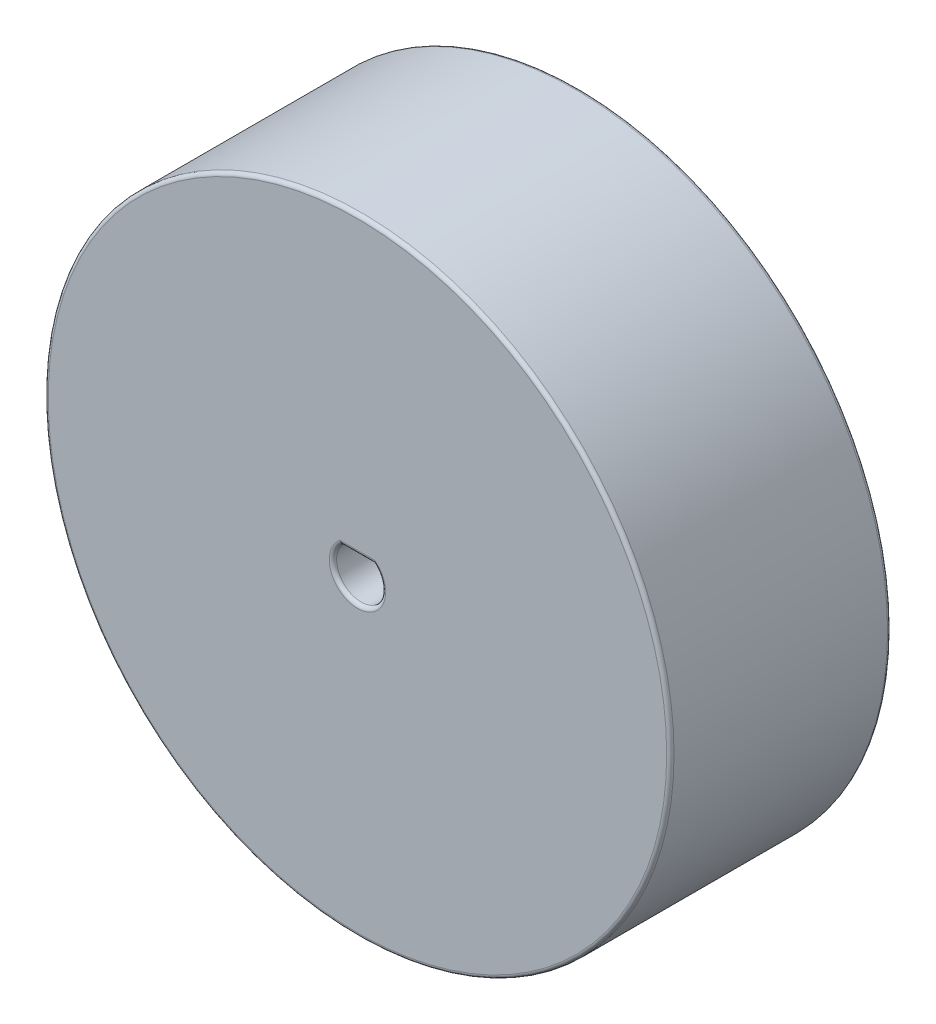
ISO-10303-21;
HEADER;
FILE_DESCRIPTION(('STEP AP214'),'2;1');
FILE_NAME('part.step','',(''),(''),'','','');
FILE_SCHEMA(('AUTOMOTIVE_DESIGN { 1 0 10303 214 1 1 1 1 }'));
ENDSEC;
DATA;
#1=APPLICATION_CONTEXT('core data for automotive mechanical design processes');
#2=APPLICATION_PROTOCOL_DEFINITION('international standard','automotive_design',2000,#1);
#3=PRODUCT_CONTEXT('',#1,'mechanical');
#4=PRODUCT('Part','Part','',(#3));
#5=PRODUCT_RELATED_PRODUCT_CATEGORY('part','',(#4));
#6=PRODUCT_DEFINITION_FORMATION('','',#4);
#7=PRODUCT_DEFINITION_CONTEXT('part definition',#1,'design');
#8=PRODUCT_DEFINITION('design','',#6,#7);
#9=PRODUCT_DEFINITION_SHAPE('','',#8);
#10=(LENGTH_UNIT() NAMED_UNIT(*) SI_UNIT(.MILLI.,.METRE.));
#11=(NAMED_UNIT(*) PLANE_ANGLE_UNIT() SI_UNIT($,.RADIAN.));
#12=(NAMED_UNIT(*) SI_UNIT($,.STERADIAN.) SOLID_ANGLE_UNIT());
#13=UNCERTAINTY_MEASURE_WITH_UNIT(LENGTH_MEASURE(1.E-05),#10,'distance_accuracy_value','');
#14=(GEOMETRIC_REPRESENTATION_CONTEXT(3) GLOBAL_UNCERTAINTY_ASSIGNED_CONTEXT((#13)) GLOBAL_UNIT_ASSIGNED_CONTEXT((#10,
#11,#12)) REPRESENTATION_CONTEXT('',''));
#15=CARTESIAN_POINT('',(0.,0.,0.));
#16=DIRECTION('',(0.,0.,1.));
#17=DIRECTION('',(1.,0.,0.));
#18=AXIS2_PLACEMENT_3D('',#15,#16,#17);
#19=CARTESIAN_POINT('',(0.,0.,0.));
#20=DIRECTION('',(0.,0.,1.));
#21=DIRECTION('',(1.,0.,0.));
#22=AXIS2_PLACEMENT_3D('',#19,#20,#21);
#23=PLANE('',#22);
#24=CARTESIAN_POINT('',(0.,0.,0.));
#25=DIRECTION('',(0.,0.,1.));
#26=DIRECTION('',(1.,0.,0.));
#27=AXIS2_PLACEMENT_3D('',#24,#25,#26);
#28=CIRCLE('',#27,25.2);
#29=CARTESIAN_POINT('',(25.2,0.,0.));
#30=VERTEX_POINT('',#29);
#31=EDGE_CURVE('E11',#30,#30,#28,.F.);
#32=ORIENTED_EDGE('',*,*,#31,.T.);
#33=EDGE_LOOP('',(#32));
#34=FACE_BOUND('',#33,.T.);
#35=CARTESIAN_POINT('',(0.,0.,0.));
#36=DIRECTION('',(0.,0.,-1.));
#37=DIRECTION('',(-1.,0.,0.));
#38=AXIS2_PLACEMENT_3D('',#35,#36,#37);
#39=CIRCLE('',#38,4.00020877501328);
#40=CARTESIAN_POINT('',(3.70832445232254,-1.5,0.));
#41=VERTEX_POINT('',#40);
#42=CARTESIAN_POINT('',(1.5,-3.70832445232254,0.));
#43=VERTEX_POINT('',#42);
#44=EDGE_CURVE('E230',#41,#43,#39,.T.);
#45=ORIENTED_EDGE('',*,*,#44,.T.);
#46=DIRECTION('',(0.,-1.,0.));
#47=VECTOR('',#46,1.);
#48=CARTESIAN_POINT('',(1.5,0.,0.));
#49=LINE('',#48,#47);
#50=CARTESIAN_POINT('',(1.5,-23.953079134007,0.));
#51=VERTEX_POINT('',#50);
#52=EDGE_CURVE('E221',#43,#51,#49,.T.);
#53=ORIENTED_EDGE('',*,*,#52,.T.);
#54=CARTESIAN_POINT('',(0.,0.,0.));
#55=DIRECTION('',(0.,0.,-1.));
#56=DIRECTION('',(-1.,0.,0.));
#57=AXIS2_PLACEMENT_3D('',#54,#55,#56);
#58=CIRCLE('',#57,24.);
#59=CARTESIAN_POINT('',(23.953079134007,-1.5,0.));
#60=VERTEX_POINT('',#59);
#61=EDGE_CURVE('E237',#60,#51,#58,.T.);
#62=ORIENTED_EDGE('',*,*,#61,.F.);
#63=DIRECTION('',(1.,0.,0.));
#64=VECTOR('',#63,1.);
#65=CARTESIAN_POINT('',(0.,-1.5,0.));
#66=LINE('',#65,#64);
#67=EDGE_CURVE('E233',#41,#60,#66,.T.);
#68=ORIENTED_EDGE('',*,*,#67,.F.);
#69=EDGE_LOOP('',(#45,#53,#62,#68));
#70=FACE_BOUND('',#69,.T.);
#71=CARTESIAN_POINT('',(0.,0.,0.));
#72=DIRECTION('',(0.,0.,-1.));
#73=DIRECTION('',(-1.,0.,0.));
#74=AXIS2_PLACEMENT_3D('',#71,#72,#73);
#75=CIRCLE('',#74,4.00020877501328);
#76=CARTESIAN_POINT('',(-3.70832445232254,1.5,0.));
#77=VERTEX_POINT('',#76);
#78=CARTESIAN_POINT('',(-1.5,3.70832445232254,0.));
#79=VERTEX_POINT('',#78);
#80=EDGE_CURVE('E213',#77,#79,#75,.T.);
#81=ORIENTED_EDGE('',*,*,#80,.T.);
#82=DIRECTION('',(0.,1.,0.));
#83=VECTOR('',#82,1.);
#84=CARTESIAN_POINT('',(-1.5,0.,0.));
#85=LINE('',#84,#83);
#86=CARTESIAN_POINT('',(-1.5,23.953079134007,0.));
#87=VERTEX_POINT('',#86);
#88=EDGE_CURVE('E286',#79,#87,#85,.T.);
#89=ORIENTED_EDGE('',*,*,#88,.T.);
#90=CARTESIAN_POINT('',(0.,0.,0.));
#91=DIRECTION('',(0.,0.,-1.));
#92=DIRECTION('',(-1.,0.,0.));
#93=AXIS2_PLACEMENT_3D('',#90,#91,#92);
#94=CIRCLE('',#93,24.);
#95=CARTESIAN_POINT('',(-23.953079134007,1.5,0.));
#96=VERTEX_POINT('',#95);
#97=EDGE_CURVE('E300',#96,#87,#94,.T.);
#98=ORIENTED_EDGE('',*,*,#97,.F.);
#99=DIRECTION('',(-1.,0.,0.));
#100=VECTOR('',#99,1.);
#101=CARTESIAN_POINT('',(0.,1.5,0.));
#102=LINE('',#101,#100);
#103=EDGE_CURVE('E297',#77,#96,#102,.T.);
#104=ORIENTED_EDGE('',*,*,#103,.F.);
#105=EDGE_LOOP('',(#81,#89,#98,#104));
#106=FACE_BOUND('',#105,.T.);
#107=CARTESIAN_POINT('',(0.,0.,0.));
#108=DIRECTION('',(0.,0.,-1.));
#109=DIRECTION('',(-1.,0.,0.));
#110=AXIS2_PLACEMENT_3D('',#107,#108,#109);
#111=CIRCLE('',#110,4.00020877501328);
#112=CARTESIAN_POINT('',(-1.5,-3.70832445232254,0.));
#113=VERTEX_POINT('',#112);
#114=CARTESIAN_POINT('',(-3.70832445232254,-1.5,0.));
#115=VERTEX_POINT('',#114);
#116=EDGE_CURVE('E263',#113,#115,#111,.T.);
#117=ORIENTED_EDGE('',*,*,#116,.T.);
#118=DIRECTION('',(-1.,0.,0.));
#119=VECTOR('',#118,1.);
#120=CARTESIAN_POINT('',(0.,-1.5,0.));
#121=LINE('',#120,#119);
#122=CARTESIAN_POINT('',(-23.953079134007,-1.5,0.));
#123=VERTEX_POINT('',#122);
#124=EDGE_CURVE('E254',#115,#123,#121,.T.);
#125=ORIENTED_EDGE('',*,*,#124,.T.);
#126=CARTESIAN_POINT('',(0.,0.,0.));
#127=DIRECTION('',(0.,0.,-1.));
#128=DIRECTION('',(-1.,0.,0.));
#129=AXIS2_PLACEMENT_3D('',#126,#127,#128);
#130=CIRCLE('',#129,24.);
#131=CARTESIAN_POINT('',(-1.5,-23.953079134007,0.));
#132=VERTEX_POINT('',#131);
#133=EDGE_CURVE('E269',#132,#123,#130,.T.);
#134=ORIENTED_EDGE('',*,*,#133,.F.);
#135=DIRECTION('',(0.,-1.,0.));
#136=VECTOR('',#135,1.);
#137=CARTESIAN_POINT('',(-1.5,0.,0.));
#138=LINE('',#137,#136);
#139=EDGE_CURVE('E266',#113,#132,#138,.T.);
#140=ORIENTED_EDGE('',*,*,#139,.F.);
#141=EDGE_LOOP('',(#117,#125,#134,#140));
#142=FACE_BOUND('',#141,.T.);
#143=CARTESIAN_POINT('',(0.,0.,0.));
#144=DIRECTION('',(0.,0.,-1.));
#145=DIRECTION('',(-1.,0.,0.));
#146=AXIS2_PLACEMENT_3D('',#143,#144,#145);
#147=CIRCLE('',#146,4.00020877501328);
#148=CARTESIAN_POINT('',(1.5,3.70832445232254,0.));
#149=VERTEX_POINT('',#148);
#150=CARTESIAN_POINT('',(3.70832445232254,1.5,0.));
#151=VERTEX_POINT('',#150);
#152=EDGE_CURVE('E180',#149,#151,#147,.T.);
#153=ORIENTED_EDGE('',*,*,#152,.T.);
#154=DIRECTION('',(1.,0.,0.));
#155=VECTOR('',#154,1.);
#156=CARTESIAN_POINT('',(0.,1.5,0.));
#157=LINE('',#156,#155);
#158=CARTESIAN_POINT('',(23.953079134007,1.5,0.));
#159=VERTEX_POINT('',#158);
#160=EDGE_CURVE('E193',#151,#159,#157,.T.);
#161=ORIENTED_EDGE('',*,*,#160,.T.);
#162=CARTESIAN_POINT('',(0.,0.,0.));
#163=DIRECTION('',(0.,0.,-1.));
#164=DIRECTION('',(-1.,0.,0.));
#165=AXIS2_PLACEMENT_3D('',#162,#163,#164);
#166=CIRCLE('',#165,24.);
#167=CARTESIAN_POINT('',(1.5,23.953079134007,0.));
#168=VERTEX_POINT('',#167);
#169=EDGE_CURVE('E206',#168,#159,#166,.T.);
#170=ORIENTED_EDGE('',*,*,#169,.F.);
#171=DIRECTION('',(0.,1.,0.));
#172=VECTOR('',#171,1.);
#173=CARTESIAN_POINT('',(1.5,0.,0.));
#174=LINE('',#173,#172);
#175=EDGE_CURVE('E203',#149,#168,#174,.T.);
#176=ORIENTED_EDGE('',*,*,#175,.F.);
#177=EDGE_LOOP('',(#153,#161,#170,#176));
#178=FACE_BOUND('',#177,.T.);
#179=ADVANCED_FACE('F34',(#34,#70,#106,#142,#178),#23,.F.);
#180=CARTESIAN_POINT('',(0.,0.,18.));
#181=DIRECTION('',(0.,0.,-1.));
#182=DIRECTION('',(-1.,0.,0.));
#183=AXIS2_PLACEMENT_3D('',#180,#181,#182);
#184=CYLINDRICAL_SURFACE('',#183,25.5);
#185=CARTESIAN_POINT('',(0.,0.,17.7));
#186=DIRECTION('',(0.,0.,1.));
#187=DIRECTION('',(1.,0.,0.));
#188=AXIS2_PLACEMENT_3D('',#185,#186,#187);
#189=CIRCLE('',#188,25.5);
#190=CARTESIAN_POINT('',(25.5,0.,17.7));
#191=VERTEX_POINT('',#190);
#192=EDGE_CURVE('E49',#191,#191,#189,.F.);
#193=ORIENTED_EDGE('',*,*,#192,.T.);
#194=EDGE_LOOP('',(#193));
#195=FACE_BOUND('',#194,.T.);
#196=CARTESIAN_POINT('',(0.,0.,0.300000000000002));
#197=DIRECTION('',(0.,0.,1.));
#198=DIRECTION('',(1.,0.,0.));
#199=AXIS2_PLACEMENT_3D('',#196,#197,#198);
#200=CIRCLE('',#199,25.5);
#201=CARTESIAN_POINT('',(25.5,0.,0.300000000000002));
#202=VERTEX_POINT('',#201);
#203=EDGE_CURVE('E337',#202,#202,#200,.T.);
#204=ORIENTED_EDGE('',*,*,#203,.T.);
#205=EDGE_LOOP('',(#204));
#206=FACE_BOUND('',#205,.T.);
#207=ADVANCED_FACE('F365',(#195,#206),#184,.T.);
#208=CARTESIAN_POINT('',(0.,0.,18.));
#209=DIRECTION('',(0.,0.,1.));
#210=DIRECTION('',(1.,0.,0.));
#211=AXIS2_PLACEMENT_3D('',#208,#209,#210);
#212=PLANE('',#211);
#213=CARTESIAN_POINT('',(0.,0.,18.));
#214=DIRECTION('',(0.,0.,1.));
#215=DIRECTION('',(1.,0.,0.));
#216=AXIS2_PLACEMENT_3D('',#213,#214,#215);
#217=CIRCLE('',#216,2.3);
#218=CARTESIAN_POINT('',(1.43178210633003,1.79999999999809,18.));
#219=VERTEX_POINT('',#218);
#220=CARTESIAN_POINT('',(-1.43178210633003,1.79999999999809,18.));
#221=VERTEX_POINT('',#220);
#222=EDGE_CURVE('E56',#219,#221,#217,.F.);
#223=ORIENTED_EDGE('',*,*,#222,.T.);
#224=DIRECTION('',(-1.,0.,0.));
#225=VECTOR('',#224,1.);
#226=CARTESIAN_POINT('',(1.3228756555323,1.8,18.));
#227=LINE('',#226,#225);
#228=EDGE_CURVE('E333',#221,#219,#227,.F.);
#229=ORIENTED_EDGE('',*,*,#228,.T.);
#230=EDGE_LOOP('',(#223,#229));
#231=FACE_BOUND('',#230,.T.);
#232=CARTESIAN_POINT('',(0.,0.,18.));
#233=DIRECTION('',(0.,0.,1.));
#234=DIRECTION('',(1.,0.,0.));
#235=AXIS2_PLACEMENT_3D('',#232,#233,#234);
#236=CIRCLE('',#235,25.2);
#237=CARTESIAN_POINT('',(25.2,0.,18.));
#238=VERTEX_POINT('',#237);
#239=EDGE_CURVE('E329',#238,#238,#236,.T.);
#240=ORIENTED_EDGE('',*,*,#239,.T.);
#241=EDGE_LOOP('',(#240));
#242=FACE_BOUND('',#241,.T.);
#243=ADVANCED_FACE('F371',(#231,#242),#212,.T.);
#244=CARTESIAN_POINT('',(0.,0.,8.));
#245=DIRECTION('',(0.,0.,1.));
#246=DIRECTION('',(1.,0.,0.));
#247=AXIS2_PLACEMENT_3D('',#244,#245,#246);
#248=CYLINDRICAL_SURFACE('',#247,2.);
#249=DIRECTION('',(0.,0.,1.));
#250=VECTOR('',#249,1.);
#251=CARTESIAN_POINT('',(-1.3228756555323,1.5,8.));
#252=LINE('',#251,#250);
#253=CARTESIAN_POINT('',(-1.3228756555323,1.5,8.));
#254=VERTEX_POINT('',#253);
#255=CARTESIAN_POINT('',(-1.3228756555323,1.5,17.7));
#256=VERTEX_POINT('',#255);
#257=EDGE_CURVE('E321',#254,#256,#252,.T.);
#258=ORIENTED_EDGE('',*,*,#257,.T.);
#259=CARTESIAN_POINT('',(0.,0.,17.7));
#260=DIRECTION('',(0.,0.,1.));
#261=DIRECTION('',(1.,0.,0.));
#262=AXIS2_PLACEMENT_3D('',#259,#260,#261);
#263=CIRCLE('',#262,2.);
#264=CARTESIAN_POINT('',(1.3228756555323,1.5,17.7));
#265=VERTEX_POINT('',#264);
#266=EDGE_CURVE('E335',#256,#265,#263,.T.);
#267=ORIENTED_EDGE('',*,*,#266,.T.);
#268=DIRECTION('',(0.,0.,1.));
#269=VECTOR('',#268,1.);
#270=CARTESIAN_POINT('',(1.3228756555323,1.5,8.));
#271=LINE('',#270,#269);
#272=CARTESIAN_POINT('',(1.3228756555323,1.5,8.));
#273=VERTEX_POINT('',#272);
#274=EDGE_CURVE('E320',#273,#265,#271,.T.);
#275=ORIENTED_EDGE('',*,*,#274,.F.);
#276=CARTESIAN_POINT('',(0.,0.,8.));
#277=DIRECTION('',(0.,0.,1.));
#278=DIRECTION('',(-1.,0.,0.));
#279=AXIS2_PLACEMENT_3D('',#276,#277,#278);
#280=CIRCLE('',#279,2.);
#281=EDGE_CURVE('E308',#254,#273,#280,.T.);
#282=ORIENTED_EDGE('',*,*,#281,.F.);
#283=EDGE_LOOP('',(#258,#267,#275,#282));
#284=FACE_BOUND('',#283,.T.);
#285=ADVANCED_FACE('F377',(#284),#248,.F.);
#286=CARTESIAN_POINT('',(1.3228756555323,1.5,8.));
#287=DIRECTION('',(0.,1.,0.));
#288=DIRECTION('',(0.,0.,1.));
#289=AXIS2_PLACEMENT_3D('',#286,#287,#288);
#290=PLANE('',#289);
#291=ORIENTED_EDGE('',*,*,#274,.T.);
#292=DIRECTION('',(-1.,0.,0.));
#293=VECTOR('',#292,1.);
#294=CARTESIAN_POINT('',(-1.3228756555323,1.5,17.7));
#295=LINE('',#294,#293);
#296=EDGE_CURVE('E324',#265,#256,#295,.T.);
#297=ORIENTED_EDGE('',*,*,#296,.T.);
#298=ORIENTED_EDGE('',*,*,#257,.F.);
#299=DIRECTION('',(-1.,0.,0.));
#300=VECTOR('',#299,1.);
#301=CARTESIAN_POINT('',(1.3228756555323,1.5,8.));
#302=LINE('',#301,#300);
#303=EDGE_CURVE('E317',#273,#254,#302,.T.);
#304=ORIENTED_EDGE('',*,*,#303,.F.);
#305=EDGE_LOOP('',(#291,#297,#298,#304));
#306=FACE_BOUND('',#305,.T.);
#307=ADVANCED_FACE('F380',(#306),#290,.F.);
#308=CARTESIAN_POINT('',(0.,0.,8.));
#309=DIRECTION('',(0.,0.,-1.));
#310=DIRECTION('',(-1.,0.,0.));
#311=AXIS2_PLACEMENT_3D('',#308,#309,#310);
#312=PLANE('',#311);
#313=ORIENTED_EDGE('',*,*,#281,.T.);
#314=ORIENTED_EDGE('',*,*,#303,.T.);
#315=EDGE_LOOP('',(#313,#314));
#316=FACE_BOUND('',#315,.T.);
#317=ADVANCED_FACE('F384',(#316),#312,.F.);
#318=CARTESIAN_POINT('',(0.,0.,5.));
#319=DIRECTION('',(0.,0.,-1.));
#320=DIRECTION('',(-1.,0.,0.));
#321=AXIS2_PLACEMENT_3D('',#318,#319,#320);
#322=CYLINDRICAL_SURFACE('',#321,4.00020877501328);
#323=ORIENTED_EDGE('',*,*,#80,.F.);
#324=DIRECTION('',(0.,0.,-1.));
#325=VECTOR('',#324,1.);
#326=CARTESIAN_POINT('',(-3.70832445232254,1.5,5.));
#327=LINE('',#326,#325);
#328=CARTESIAN_POINT('',(-3.70832445232254,1.5,5.));
#329=VERTEX_POINT('',#328);
#330=EDGE_CURVE('E294',#329,#77,#327,.T.);
#331=ORIENTED_EDGE('',*,*,#330,.F.);
#332=CARTESIAN_POINT('',(0.,0.,5.));
#333=DIRECTION('',(0.,0.,-1.));
#334=DIRECTION('',(-1.,0.,0.));
#335=AXIS2_PLACEMENT_3D('',#332,#333,#334);
#336=CIRCLE('',#335,4.00020877501328);
#337=CARTESIAN_POINT('',(-1.5,3.70832445232254,5.));
#338=VERTEX_POINT('',#337);
#339=EDGE_CURVE('E282',#329,#338,#336,.T.);
#340=ORIENTED_EDGE('',*,*,#339,.T.);
#341=DIRECTION('',(0.,0.,-1.));
#342=VECTOR('',#341,1.);
#343=CARTESIAN_POINT('',(-1.5,3.70832445232254,5.));
#344=LINE('',#343,#342);
#345=EDGE_CURVE('E305',#338,#79,#344,.T.);
#346=ORIENTED_EDGE('',*,*,#345,.T.);
#347=EDGE_LOOP('',(#323,#331,#340,#346));
#348=FACE_BOUND('',#347,.T.);
#349=ADVANCED_FACE('F388',(#348),#322,.T.);
#350=CARTESIAN_POINT('',(-1.5,0.,5.));
#351=DIRECTION('',(-1.,0.,0.));
#352=DIRECTION('',(0.,0.,1.));
#353=AXIS2_PLACEMENT_3D('',#350,#351,#352);
#354=PLANE('',#353);
#355=ORIENTED_EDGE('',*,*,#88,.F.);
#356=ORIENTED_EDGE('',*,*,#345,.F.);
#357=DIRECTION('',(0.,1.,0.));
#358=VECTOR('',#357,1.);
#359=CARTESIAN_POINT('',(-1.5,0.,5.));
#360=LINE('',#359,#358);
#361=CARTESIAN_POINT('',(-1.5,23.953079134007,5.));
#362=VERTEX_POINT('',#361);
#363=EDGE_CURVE('E292',#338,#362,#360,.T.);
#364=ORIENTED_EDGE('',*,*,#363,.T.);
#365=DIRECTION('',(0.,0.,-1.));
#366=VECTOR('',#365,1.);
#367=CARTESIAN_POINT('',(-1.5,23.953079134007,5.));
#368=LINE('',#367,#366);
#369=EDGE_CURVE('E309',#362,#87,#368,.T.);
#370=ORIENTED_EDGE('',*,*,#369,.T.);
#371=EDGE_LOOP('',(#355,#356,#364,#370));
#372=FACE_BOUND('',#371,.T.);
#373=ADVANCED_FACE('F392',(#372),#354,.T.);
#374=CARTESIAN_POINT('',(0.,0.,5.));
#375=DIRECTION('',(0.,0.,-1.));
#376=DIRECTION('',(-1.,0.,0.));
#377=AXIS2_PLACEMENT_3D('',#374,#375,#376);
#378=CYLINDRICAL_SURFACE('',#377,24.);
#379=ORIENTED_EDGE('',*,*,#97,.T.);
#380=ORIENTED_EDGE('',*,*,#369,.F.);
#381=CARTESIAN_POINT('',(0.,0.,5.));
#382=DIRECTION('',(0.,0.,-1.));
#383=DIRECTION('',(-1.,0.,0.));
#384=AXIS2_PLACEMENT_3D('',#381,#382,#383);
#385=CIRCLE('',#384,24.);
#386=CARTESIAN_POINT('',(-23.953079134007,1.5,5.));
#387=VERTEX_POINT('',#386);
#388=EDGE_CURVE('E289',#387,#362,#385,.T.);
#389=ORIENTED_EDGE('',*,*,#388,.F.);
#390=DIRECTION('',(0.,0.,-1.));
#391=VECTOR('',#390,1.);
#392=CARTESIAN_POINT('',(-23.953079134007,1.5,5.));
#393=LINE('',#392,#391);
#394=EDGE_CURVE('E311',#387,#96,#393,.T.);
#395=ORIENTED_EDGE('',*,*,#394,.T.);
#396=EDGE_LOOP('',(#379,#380,#389,#395));
#397=FACE_BOUND('',#396,.T.);
#398=ADVANCED_FACE('F398',(#397),#378,.F.);
#399=CARTESIAN_POINT('',(0.,1.5,5.));
#400=DIRECTION('',(0.,-1.,0.));
#401=DIRECTION('',(0.,0.,-1.));
#402=AXIS2_PLACEMENT_3D('',#399,#400,#401);
#403=PLANE('',#402);
#404=ORIENTED_EDGE('',*,*,#103,.T.);
#405=ORIENTED_EDGE('',*,*,#394,.F.);
#406=DIRECTION('',(-1.,0.,0.));
#407=VECTOR('',#406,1.);
#408=CARTESIAN_POINT('',(0.,1.5,5.));
#409=LINE('',#408,#407);
#410=EDGE_CURVE('E285',#329,#387,#409,.T.);
#411=ORIENTED_EDGE('',*,*,#410,.F.);
#412=ORIENTED_EDGE('',*,*,#330,.T.);
#413=EDGE_LOOP('',(#404,#405,#411,#412));
#414=FACE_BOUND('',#413,.T.);
#415=ADVANCED_FACE('F394',(#414),#403,.F.);
#416=CARTESIAN_POINT('',(0.,0.,5.));
#417=DIRECTION('',(0.,0.,-1.));
#418=DIRECTION('',(-1.,0.,0.));
#419=AXIS2_PLACEMENT_3D('',#416,#417,#418);
#420=PLANE('',#419);
#421=ORIENTED_EDGE('',*,*,#339,.F.);
#422=ORIENTED_EDGE('',*,*,#410,.T.);
#423=ORIENTED_EDGE('',*,*,#388,.T.);
#424=ORIENTED_EDGE('',*,*,#363,.F.);
#425=EDGE_LOOP('',(#421,#422,#423,#424));
#426=FACE_BOUND('',#425,.T.);
#427=ADVANCED_FACE('F397',(#426),#420,.T.);
#428=CARTESIAN_POINT('',(0.,0.,5.));
#429=DIRECTION('',(0.,0.,-1.));
#430=DIRECTION('',(-1.,0.,0.));
#431=AXIS2_PLACEMENT_3D('',#428,#429,#430);
#432=CYLINDRICAL_SURFACE('',#431,4.00020877501328);
#433=ORIENTED_EDGE('',*,*,#116,.F.);
#434=DIRECTION('',(0.,0.,-1.));
#435=VECTOR('',#434,1.);
#436=CARTESIAN_POINT('',(-1.5,-3.70832445232254,5.));
#437=LINE('',#436,#435);
#438=CARTESIAN_POINT('',(-1.5,-3.70832445232254,5.));
#439=VERTEX_POINT('',#438);
#440=EDGE_CURVE('E262',#439,#113,#437,.T.);
#441=ORIENTED_EDGE('',*,*,#440,.F.);
#442=CARTESIAN_POINT('',(0.,0.,5.));
#443=DIRECTION('',(0.,0.,-1.));
#444=DIRECTION('',(-1.,0.,0.));
#445=AXIS2_PLACEMENT_3D('',#442,#443,#444);
#446=CIRCLE('',#445,4.00020877501328);
#447=CARTESIAN_POINT('',(-3.70832445232254,-1.5,5.));
#448=VERTEX_POINT('',#447);
#449=EDGE_CURVE('E250',#439,#448,#446,.T.);
#450=ORIENTED_EDGE('',*,*,#449,.T.);
#451=DIRECTION('',(0.,0.,-1.));
#452=VECTOR('',#451,1.);
#453=CARTESIAN_POINT('',(-3.70832445232254,-1.5,5.));
#454=LINE('',#453,#452);
#455=EDGE_CURVE('E234',#448,#115,#454,.T.);
#456=ORIENTED_EDGE('',*,*,#455,.T.);
#457=EDGE_LOOP('',(#433,#441,#450,#456));
#458=FACE_BOUND('',#457,.T.);
#459=ADVANCED_FACE('F408',(#458),#432,.T.);
#460=CARTESIAN_POINT('',(0.,-1.5,5.));
#461=DIRECTION('',(0.,-1.,0.));
#462=DIRECTION('',(0.,0.,-1.));
#463=AXIS2_PLACEMENT_3D('',#460,#461,#462);
#464=PLANE('',#463);
#465=ORIENTED_EDGE('',*,*,#124,.F.);
#466=ORIENTED_EDGE('',*,*,#455,.F.);
#467=DIRECTION('',(-1.,0.,0.));
#468=VECTOR('',#467,1.);
#469=CARTESIAN_POINT('',(0.,-1.5,5.));
#470=LINE('',#469,#468);
#471=CARTESIAN_POINT('',(-23.953079134007,-1.5,5.));
#472=VERTEX_POINT('',#471);
#473=EDGE_CURVE('E260',#448,#472,#470,.T.);
#474=ORIENTED_EDGE('',*,*,#473,.T.);
#475=DIRECTION('',(0.,0.,-1.));
#476=VECTOR('',#475,1.);
#477=CARTESIAN_POINT('',(-23.953079134007,-1.5,5.));
#478=LINE('',#477,#476);
#479=EDGE_CURVE('E276',#472,#123,#478,.T.);
#480=ORIENTED_EDGE('',*,*,#479,.T.);
#481=EDGE_LOOP('',(#465,#466,#474,#480));
#482=FACE_BOUND('',#481,.T.);
#483=ADVANCED_FACE('F412',(#482),#464,.T.);
#484=CARTESIAN_POINT('',(0.,0.,5.));
#485=DIRECTION('',(0.,0.,-1.));
#486=DIRECTION('',(-1.,0.,0.));
#487=AXIS2_PLACEMENT_3D('',#484,#485,#486);
#488=CYLINDRICAL_SURFACE('',#487,24.);
#489=ORIENTED_EDGE('',*,*,#133,.T.);
#490=ORIENTED_EDGE('',*,*,#479,.F.);
#491=CARTESIAN_POINT('',(0.,0.,5.));
#492=DIRECTION('',(0.,0.,-1.));
#493=DIRECTION('',(-1.,0.,0.));
#494=AXIS2_PLACEMENT_3D('',#491,#492,#493);
#495=CIRCLE('',#494,24.);
#496=CARTESIAN_POINT('',(-1.5,-23.953079134007,5.));
#497=VERTEX_POINT('',#496);
#498=EDGE_CURVE('E257',#497,#472,#495,.T.);
#499=ORIENTED_EDGE('',*,*,#498,.F.);
#500=DIRECTION('',(0.,0.,-1.));
#501=VECTOR('',#500,1.);
#502=CARTESIAN_POINT('',(-1.5,-23.953079134007,5.));
#503=LINE('',#502,#501);
#504=EDGE_CURVE('E278',#497,#132,#503,.T.);
#505=ORIENTED_EDGE('',*,*,#504,.T.);
#506=EDGE_LOOP('',(#489,#490,#499,#505));
#507=FACE_BOUND('',#506,.T.);
#508=ADVANCED_FACE('F418',(#507),#488,.F.);
#509=CARTESIAN_POINT('',(-1.5,0.,5.));
#510=DIRECTION('',(1.,0.,0.));
#511=DIRECTION('',(0.,1.,0.));
#512=AXIS2_PLACEMENT_3D('',#509,#510,#511);
#513=PLANE('',#512);
#514=ORIENTED_EDGE('',*,*,#139,.T.);
#515=ORIENTED_EDGE('',*,*,#504,.F.);
#516=DIRECTION('',(0.,-1.,0.));
#517=VECTOR('',#516,1.);
#518=CARTESIAN_POINT('',(-1.5,0.,5.));
#519=LINE('',#518,#517);
#520=EDGE_CURVE('E253',#439,#497,#519,.T.);
#521=ORIENTED_EDGE('',*,*,#520,.F.);
#522=ORIENTED_EDGE('',*,*,#440,.T.);
#523=EDGE_LOOP('',(#514,#515,#521,#522));
#524=FACE_BOUND('',#523,.T.);
#525=ADVANCED_FACE('F414',(#524),#513,.F.);
#526=CARTESIAN_POINT('',(0.,0.,5.));
#527=DIRECTION('',(0.,0.,-1.));
#528=DIRECTION('',(-1.,0.,0.));
#529=AXIS2_PLACEMENT_3D('',#526,#527,#528);
#530=PLANE('',#529);
#531=ORIENTED_EDGE('',*,*,#449,.F.);
#532=ORIENTED_EDGE('',*,*,#520,.T.);
#533=ORIENTED_EDGE('',*,*,#498,.T.);
#534=ORIENTED_EDGE('',*,*,#473,.F.);
#535=EDGE_LOOP('',(#531,#532,#533,#534));
#536=FACE_BOUND('',#535,.T.);
#537=ADVANCED_FACE('F417',(#536),#530,.T.);
#538=CARTESIAN_POINT('',(0.,0.,5.));
#539=DIRECTION('',(0.,0.,-1.));
#540=DIRECTION('',(-1.,0.,0.));
#541=AXIS2_PLACEMENT_3D('',#538,#539,#540);
#542=CYLINDRICAL_SURFACE('',#541,4.00020877501328);
#543=ORIENTED_EDGE('',*,*,#44,.F.);
#544=DIRECTION('',(0.,0.,-1.));
#545=VECTOR('',#544,1.);
#546=CARTESIAN_POINT('',(3.70832445232254,-1.5,5.));
#547=LINE('',#546,#545);
#548=CARTESIAN_POINT('',(3.70832445232254,-1.5,5.));
#549=VERTEX_POINT('',#548);
#550=EDGE_CURVE('E229',#549,#41,#547,.T.);
#551=ORIENTED_EDGE('',*,*,#550,.F.);
#552=CARTESIAN_POINT('',(0.,0.,5.));
#553=DIRECTION('',(0.,0.,-1.));
#554=DIRECTION('',(-1.,0.,0.));
#555=AXIS2_PLACEMENT_3D('',#552,#553,#554);
#556=CIRCLE('',#555,4.00020877501328);
#557=CARTESIAN_POINT('',(1.5,-3.70832445232254,5.));
#558=VERTEX_POINT('',#557);
#559=EDGE_CURVE('E217',#549,#558,#556,.T.);
#560=ORIENTED_EDGE('',*,*,#559,.T.);
#561=DIRECTION('',(0.,0.,-1.));
#562=VECTOR('',#561,1.);
#563=CARTESIAN_POINT('',(1.5,-3.70832445232254,5.));
#564=LINE('',#563,#562);
#565=EDGE_CURVE('E204',#558,#43,#564,.T.);
#566=ORIENTED_EDGE('',*,*,#565,.T.);
#567=EDGE_LOOP('',(#543,#551,#560,#566));
#568=FACE_BOUND('',#567,.T.);
#569=ADVANCED_FACE('F428',(#568),#542,.T.);
#570=CARTESIAN_POINT('',(1.5,0.,5.));
#571=DIRECTION('',(1.,0.,0.));
#572=DIRECTION('',(0.,1.,0.));
#573=AXIS2_PLACEMENT_3D('',#570,#571,#572);
#574=PLANE('',#573);
#575=ORIENTED_EDGE('',*,*,#52,.F.);
#576=ORIENTED_EDGE('',*,*,#565,.F.);
#577=DIRECTION('',(0.,-1.,0.));
#578=VECTOR('',#577,1.);
#579=CARTESIAN_POINT('',(1.5,0.,5.));
#580=LINE('',#579,#578);
#581=CARTESIAN_POINT('',(1.5,-23.953079134007,5.));
#582=VERTEX_POINT('',#581);
#583=EDGE_CURVE('E227',#558,#582,#580,.T.);
#584=ORIENTED_EDGE('',*,*,#583,.T.);
#585=DIRECTION('',(0.,0.,-1.));
#586=VECTOR('',#585,1.);
#587=CARTESIAN_POINT('',(1.5,-23.953079134007,5.));
#588=LINE('',#587,#586);
#589=EDGE_CURVE('E244',#582,#51,#588,.T.);
#590=ORIENTED_EDGE('',*,*,#589,.T.);
#591=EDGE_LOOP('',(#575,#576,#584,#590));
#592=FACE_BOUND('',#591,.T.);
#593=ADVANCED_FACE('F432',(#592),#574,.T.);
#594=CARTESIAN_POINT('',(0.,0.,5.));
#595=DIRECTION('',(0.,0.,-1.));
#596=DIRECTION('',(-1.,0.,0.));
#597=AXIS2_PLACEMENT_3D('',#594,#595,#596);
#598=CYLINDRICAL_SURFACE('',#597,24.);
#599=ORIENTED_EDGE('',*,*,#61,.T.);
#600=ORIENTED_EDGE('',*,*,#589,.F.);
#601=CARTESIAN_POINT('',(0.,0.,5.));
#602=DIRECTION('',(0.,0.,-1.));
#603=DIRECTION('',(-1.,0.,0.));
#604=AXIS2_PLACEMENT_3D('',#601,#602,#603);
#605=CIRCLE('',#604,24.);
#606=CARTESIAN_POINT('',(23.953079134007,-1.5,5.));
#607=VERTEX_POINT('',#606);
#608=EDGE_CURVE('E224',#607,#582,#605,.T.);
#609=ORIENTED_EDGE('',*,*,#608,.F.);
#610=DIRECTION('',(0.,0.,-1.));
#611=VECTOR('',#610,1.);
#612=CARTESIAN_POINT('',(23.953079134007,-1.5,5.));
#613=LINE('',#612,#611);
#614=EDGE_CURVE('E246',#607,#60,#613,.T.);
#615=ORIENTED_EDGE('',*,*,#614,.T.);
#616=EDGE_LOOP('',(#599,#600,#609,#615));
#617=FACE_BOUND('',#616,.T.);
#618=ADVANCED_FACE('F438',(#617),#598,.F.);
#619=CARTESIAN_POINT('',(0.,-1.5,5.));
#620=DIRECTION('',(0.,1.,0.));
#621=DIRECTION('',(-1.,0.,0.));
#622=AXIS2_PLACEMENT_3D('',#619,#620,#621);
#623=PLANE('',#622);
#624=ORIENTED_EDGE('',*,*,#67,.T.);
#625=ORIENTED_EDGE('',*,*,#614,.F.);
#626=DIRECTION('',(1.,0.,0.));
#627=VECTOR('',#626,1.);
#628=CARTESIAN_POINT('',(0.,-1.5,5.));
#629=LINE('',#628,#627);
#630=EDGE_CURVE('E220',#549,#607,#629,.T.);
#631=ORIENTED_EDGE('',*,*,#630,.F.);
#632=ORIENTED_EDGE('',*,*,#550,.T.);
#633=EDGE_LOOP('',(#624,#625,#631,#632));
#634=FACE_BOUND('',#633,.T.);
#635=ADVANCED_FACE('F434',(#634),#623,.F.);
#636=CARTESIAN_POINT('',(0.,0.,5.));
#637=DIRECTION('',(0.,0.,-1.));
#638=DIRECTION('',(-1.,0.,0.));
#639=AXIS2_PLACEMENT_3D('',#636,#637,#638);
#640=PLANE('',#639);
#641=ORIENTED_EDGE('',*,*,#559,.F.);
#642=ORIENTED_EDGE('',*,*,#630,.T.);
#643=ORIENTED_EDGE('',*,*,#608,.T.);
#644=ORIENTED_EDGE('',*,*,#583,.F.);
#645=EDGE_LOOP('',(#641,#642,#643,#644));
#646=FACE_BOUND('',#645,.T.);
#647=ADVANCED_FACE('F437',(#646),#640,.T.);
#648=CARTESIAN_POINT('',(0.,0.,5.));
#649=DIRECTION('',(0.,0.,-1.));
#650=DIRECTION('',(-1.,0.,0.));
#651=AXIS2_PLACEMENT_3D('',#648,#649,#650);
#652=CYLINDRICAL_SURFACE('',#651,4.00020877501328);
#653=ORIENTED_EDGE('',*,*,#152,.F.);
#654=DIRECTION('',(0.,0.,-1.));
#655=VECTOR('',#654,1.);
#656=CARTESIAN_POINT('',(1.5,3.70832445232254,5.));
#657=LINE('',#656,#655);
#658=CARTESIAN_POINT('',(1.5,3.70832445232254,5.));
#659=VERTEX_POINT('',#658);
#660=EDGE_CURVE('E173',#659,#149,#657,.T.);
#661=ORIENTED_EDGE('',*,*,#660,.F.);
#662=CARTESIAN_POINT('',(0.,0.,5.));
#663=DIRECTION('',(0.,0.,-1.));
#664=DIRECTION('',(-1.,0.,0.));
#665=AXIS2_PLACEMENT_3D('',#662,#663,#664);
#666=CIRCLE('',#665,4.00020877501328);
#667=CARTESIAN_POINT('',(3.70832445232254,1.5,5.));
#668=VERTEX_POINT('',#667);
#669=EDGE_CURVE('E177',#659,#668,#666,.T.);
#670=ORIENTED_EDGE('',*,*,#669,.T.);
#671=DIRECTION('',(0.,0.,-1.));
#672=VECTOR('',#671,1.);
#673=CARTESIAN_POINT('',(3.70832445232254,1.5,5.));
#674=LINE('',#673,#672);
#675=EDGE_CURVE('E211',#668,#151,#674,.T.);
#676=ORIENTED_EDGE('',*,*,#675,.T.);
#677=EDGE_LOOP('',(#653,#661,#670,#676));
#678=FACE_BOUND('',#677,.T.);
#679=ADVANCED_FACE('F175',(#678),#652,.T.);
#680=CARTESIAN_POINT('',(0.,1.5,5.));
#681=DIRECTION('',(0.,1.,0.));
#682=DIRECTION('',(-1.,0.,0.));
#683=AXIS2_PLACEMENT_3D('',#680,#681,#682);
#684=PLANE('',#683);
#685=ORIENTED_EDGE('',*,*,#160,.F.);
#686=ORIENTED_EDGE('',*,*,#675,.F.);
#687=DIRECTION('',(1.,0.,0.));
#688=VECTOR('',#687,1.);
#689=CARTESIAN_POINT('',(0.,1.5,5.));
#690=LINE('',#689,#688);
#691=CARTESIAN_POINT('',(23.953079134007,1.5,5.));
#692=VERTEX_POINT('',#691);
#693=EDGE_CURVE('E186',#668,#692,#690,.T.);
#694=ORIENTED_EDGE('',*,*,#693,.T.);
#695=DIRECTION('',(0.,0.,-1.));
#696=VECTOR('',#695,1.);
#697=CARTESIAN_POINT('',(23.953079134007,1.5,5.));
#698=LINE('',#697,#696);
#699=EDGE_CURVE('E214',#692,#159,#698,.T.);
#700=ORIENTED_EDGE('',*,*,#699,.T.);
#701=EDGE_LOOP('',(#685,#686,#694,#700));
#702=FACE_BOUND('',#701,.T.);
#703=ADVANCED_FACE('F451',(#702),#684,.T.);
#704=CARTESIAN_POINT('',(0.,0.,5.));
#705=DIRECTION('',(0.,0.,-1.));
#706=DIRECTION('',(-1.,0.,0.));
#707=AXIS2_PLACEMENT_3D('',#704,#705,#706);
#708=CYLINDRICAL_SURFACE('',#707,24.);
#709=ORIENTED_EDGE('',*,*,#169,.T.);
#710=ORIENTED_EDGE('',*,*,#699,.F.);
#711=CARTESIAN_POINT('',(0.,0.,5.));
#712=DIRECTION('',(0.,0.,-1.));
#713=DIRECTION('',(-1.,0.,0.));
#714=AXIS2_PLACEMENT_3D('',#711,#712,#713);
#715=CIRCLE('',#714,24.);
#716=CARTESIAN_POINT('',(1.5,23.953079134007,5.));
#717=VERTEX_POINT('',#716);
#718=EDGE_CURVE('E197',#717,#692,#715,.T.);
#719=ORIENTED_EDGE('',*,*,#718,.F.);
#720=DIRECTION('',(0.,0.,-1.));
#721=VECTOR('',#720,1.);
#722=CARTESIAN_POINT('',(1.5,23.953079134007,5.));
#723=LINE('',#722,#721);
#724=EDGE_CURVE('E185',#717,#168,#723,.T.);
#725=ORIENTED_EDGE('',*,*,#724,.T.);
#726=EDGE_LOOP('',(#709,#710,#719,#725));
#727=FACE_BOUND('',#726,.T.);
#728=ADVANCED_FACE('F454',(#727),#708,.F.);
#729=CARTESIAN_POINT('',(1.5,0.,5.));
#730=DIRECTION('',(-1.,0.,0.));
#731=DIRECTION('',(0.,0.,1.));
#732=AXIS2_PLACEMENT_3D('',#729,#730,#731);
#733=PLANE('',#732);
#734=ORIENTED_EDGE('',*,*,#175,.T.);
#735=ORIENTED_EDGE('',*,*,#724,.F.);
#736=DIRECTION('',(0.,1.,0.));
#737=VECTOR('',#736,1.);
#738=CARTESIAN_POINT('',(1.5,0.,5.));
#739=LINE('',#738,#737);
#740=EDGE_CURVE('E192',#659,#717,#739,.T.);
#741=ORIENTED_EDGE('',*,*,#740,.F.);
#742=ORIENTED_EDGE('',*,*,#660,.T.);
#743=EDGE_LOOP('',(#734,#735,#741,#742));
#744=FACE_BOUND('',#743,.T.);
#745=ADVANCED_FACE('F195',(#744),#733,.F.);
#746=CARTESIAN_POINT('',(0.,0.,5.));
#747=DIRECTION('',(0.,0.,-1.));
#748=DIRECTION('',(-1.,0.,0.));
#749=AXIS2_PLACEMENT_3D('',#746,#747,#748);
#750=PLANE('',#749);
#751=ORIENTED_EDGE('',*,*,#669,.F.);
#752=ORIENTED_EDGE('',*,*,#740,.T.);
#753=ORIENTED_EDGE('',*,*,#718,.T.);
#754=ORIENTED_EDGE('',*,*,#693,.F.);
#755=EDGE_LOOP('',(#751,#752,#753,#754));
#756=FACE_BOUND('',#755,.T.);
#757=ADVANCED_FACE('F190',(#756),#750,.T.);
#758=CARTESIAN_POINT('',(0.,0.,17.7));
#759=DIRECTION('',(0.,0.,1.));
#760=DIRECTION('',(1.,0.,0.));
#761=AXIS2_PLACEMENT_3D('',#758,#759,#760);
#762=TOROIDAL_SURFACE('',#761,2.3,0.3);
#763=CARTESIAN_POINT('',(-1.3228756555323,1.5,17.7));
#764=CARTESIAN_POINT('',(-1.32286802890539,1.49998256442808,17.7161110096823));
#765=CARTESIAN_POINT('',(-1.32336572878322,1.50129661813576,17.7322109192357));
#766=CARTESIAN_POINT('',(-1.32531239826047,1.50645129171541,17.7639008819546));
#767=CARTESIAN_POINT('',(-1.32675891016205,1.51028538401017,17.7794921434311));
#768=CARTESIAN_POINT('',(-1.33054399058547,1.52034396910199,17.8097618291287));
#769=CARTESIAN_POINT('',(-1.33288237873378,1.52656797856269,17.8244404372278));
#770=CARTESIAN_POINT('',(-1.33835198143899,1.54117852453174,17.8525184315895));
#771=CARTESIAN_POINT('',(-1.34148344741468,1.54956574682989,17.86591741033));
#772=CARTESIAN_POINT('',(-1.34852002442547,1.56849358922453,17.8914806797381));
#773=CARTESIAN_POINT('',(-1.35244441860443,1.57908814319279,17.9035996412928));
#774=CARTESIAN_POINT('',(-1.36087098217109,1.60195208885029,17.9259032259132));
#775=CARTESIAN_POINT('',(-1.36537335917088,1.61422208246068,17.9360871506355));
#776=CARTESIAN_POINT('',(-1.37510359033096,1.64088483378167,17.9548809594363));
#777=CARTESIAN_POINT('',(-1.38035888329576,1.65536120383263,17.9633579131056));
#778=CARTESIAN_POINT('',(-1.39120348730461,1.68541778323873,17.9777561843371));
#779=CARTESIAN_POINT('',(-1.39679280702251,1.70099802126054,17.9836774355011));
#780=CARTESIAN_POINT('',(-1.40705224266589,1.72977493106094,17.9919720081935));
#781=CARTESIAN_POINT('',(-1.41169174878039,1.74285181183727,17.994809335278));
#782=CARTESIAN_POINT('',(-1.42100589468804,1.76923615768323,17.9987152864271));
#783=CARTESIAN_POINT('',(-1.4256804519305,1.78254314249541,17.9997872290187));
#784=CARTESIAN_POINT('',(-1.43081690610455,1.79723678071956,17.9999904768944));
#785=CARTESIAN_POINT('',(-1.43129964368054,1.79861843141663,18.0000000247232));
#786=CARTESIAN_POINT('',(-1.43178210632763,1.8,18.));
#787=B_SPLINE_CURVE_WITH_KNOTS('',3,(#763,#764,#765,#766,#767,#768,#769,#770,#771,#772,#773,
#774,#775,#776,#777,#778,#779,#780,#781,#782,#783,#784,#785,#786),.UNSPECIFIED.,.F.,.F.,(4,2,2,
2,2,2,2,2,2,2,2,4),(0.,0.0482546964556696,0.0963848902771826,0.144505355380428,
0.192641094604771,0.242130765496435,0.291638263136596,0.344148462167902,0.396660025351488,
0.439044513271575,0.481349236538326,0.485739851135304),.UNSPECIFIED.);
#788=EDGE_CURVE('E341',#221,#256,#787,.F.);
#789=ORIENTED_EDGE('',*,*,#788,.F.);
#790=ORIENTED_EDGE('',*,*,#222,.F.);
#791=CARTESIAN_POINT('',(1.3228756555323,1.5,17.7));
#792=CARTESIAN_POINT('',(1.32286802890539,1.49998256442808,17.7161110096823));
#793=CARTESIAN_POINT('',(1.32336572878322,1.50129661813576,17.7322109192357));
#794=CARTESIAN_POINT('',(1.32531239826047,1.50645129171541,17.7639008819546));
#795=CARTESIAN_POINT('',(1.32675891016205,1.51028538401017,17.7794921434311));
#796=CARTESIAN_POINT('',(1.33054399058547,1.52034396910199,17.8097618291287));
#797=CARTESIAN_POINT('',(1.33288237873378,1.52656797856269,17.8244404372278));
#798=CARTESIAN_POINT('',(1.33835198143899,1.54117852453174,17.8525184315895));
#799=CARTESIAN_POINT('',(1.34148344741468,1.54956574682989,17.86591741033));
#800=CARTESIAN_POINT('',(1.34852002442547,1.56849358922453,17.8914806797381));
#801=CARTESIAN_POINT('',(1.35244441860443,1.57908814319279,17.9035996412928));
#802=CARTESIAN_POINT('',(1.36087098217109,1.60195208885029,17.9259032259132));
#803=CARTESIAN_POINT('',(1.36537335917088,1.61422208246068,17.9360871506355));
#804=CARTESIAN_POINT('',(1.37510359033096,1.64088483378167,17.9548809594363));
#805=CARTESIAN_POINT('',(1.38035888329576,1.65536120383263,17.9633579131056));
#806=CARTESIAN_POINT('',(1.39120348730461,1.68541778323873,17.9777561843371));
#807=CARTESIAN_POINT('',(1.39679280702251,1.70099802126054,17.9836774355011));
#808=CARTESIAN_POINT('',(1.40705224266589,1.72977493106094,17.9919720081935));
#809=CARTESIAN_POINT('',(1.41169174878039,1.74285181183727,17.994809335278));
#810=CARTESIAN_POINT('',(1.42100589468804,1.76923615768323,17.9987152864271));
#811=CARTESIAN_POINT('',(1.4256804519305,1.78254314249541,17.9997872290187));
#812=CARTESIAN_POINT('',(1.43081690610455,1.79723678071956,17.9999904768944));
#813=CARTESIAN_POINT('',(1.43129964368054,1.79861843141663,18.0000000247232));
#814=CARTESIAN_POINT('',(1.43178210632763,1.8,18.));
#815=B_SPLINE_CURVE_WITH_KNOTS('',3,(#791,#792,#793,#794,#795,#796,#797,#798,#799,#800,#801,
#802,#803,#804,#805,#806,#807,#808,#809,#810,#811,#812,#813,#814),.UNSPECIFIED.,.F.,.F.,(4,2,2,
2,2,2,2,2,2,2,2,4),(0.,0.0482546964556696,0.0963848902771826,0.144505355380428,
0.192641094604771,0.242130765496435,0.291638263136596,0.344148462167902,0.396660025351488,
0.439044513271575,0.481349236538326,0.485739851135304),.UNSPECIFIED.);
#816=EDGE_CURVE('E38',#265,#219,#815,.T.);
#817=ORIENTED_EDGE('',*,*,#816,.F.);
#818=ORIENTED_EDGE('',*,*,#266,.F.);
#819=EDGE_LOOP('',(#789,#790,#817,#818));
#820=FACE_BOUND('',#819,.T.);
#821=ADVANCED_FACE('F349',(#820),#762,.T.);
#822=CARTESIAN_POINT('',(1.3228756555323,1.8,17.7));
#823=DIRECTION('',(1.,0.,0.));
#824=DIRECTION('',(0.,0.,-1.));
#825=AXIS2_PLACEMENT_3D('',#822,#823,#824);
#826=CYLINDRICAL_SURFACE('',#825,0.3);
#827=ORIENTED_EDGE('',*,*,#816,.T.);
#828=ORIENTED_EDGE('',*,*,#228,.F.);
#829=ORIENTED_EDGE('',*,*,#788,.T.);
#830=ORIENTED_EDGE('',*,*,#296,.F.);
#831=EDGE_LOOP('',(#827,#828,#829,#830));
#832=FACE_BOUND('',#831,.T.);
#833=ADVANCED_FACE('F346',(#832),#826,.T.);
#834=CARTESIAN_POINT('',(0.,0.,17.7));
#835=DIRECTION('',(0.,0.,1.));
#836=DIRECTION('',(1.,0.,0.));
#837=AXIS2_PLACEMENT_3D('',#834,#835,#836);
#838=TOROIDAL_SURFACE('',#837,25.2,0.3);
#839=ORIENTED_EDGE('',*,*,#192,.F.);
#840=EDGE_LOOP('',(#839));
#841=FACE_BOUND('',#840,.T.);
#842=ORIENTED_EDGE('',*,*,#239,.F.);
#843=EDGE_LOOP('',(#842));
#844=FACE_BOUND('',#843,.T.);
#845=ADVANCED_FACE('F353',(#841,#844),#838,.T.);
#846=CARTESIAN_POINT('',(0.,0.,0.300000000000002));
#847=DIRECTION('',(0.,0.,1.));
#848=DIRECTION('',(1.,0.,0.));
#849=AXIS2_PLACEMENT_3D('',#846,#847,#848);
#850=TOROIDAL_SURFACE('',#849,25.2,0.3);
#851=ORIENTED_EDGE('',*,*,#31,.F.);
#852=EDGE_LOOP('',(#851));
#853=FACE_BOUND('',#852,.T.);
#854=ORIENTED_EDGE('',*,*,#203,.F.);
#855=EDGE_LOOP('',(#854));
#856=FACE_BOUND('',#855,.T.);
#857=ADVANCED_FACE('F36',(#853,#856),#850,.T.);
#858=CLOSED_SHELL('',(#179,#207,#243,#285,#307,#317,#349,#373,#398,#415,#427,#459,#483,#508,
#525,#537,#569,#593,#618,#635,#647,#679,#703,#728,#745,#757,#821,#833,#845,#857));
#859=MANIFOLD_SOLID_BREP('B2',#858);
#860=ADVANCED_BREP_SHAPE_REPRESENTATION('',(#18,#859),#14);
#861=SHAPE_DEFINITION_REPRESENTATION(#9,#860);
ENDSEC;
END-ISO-10303-21;
